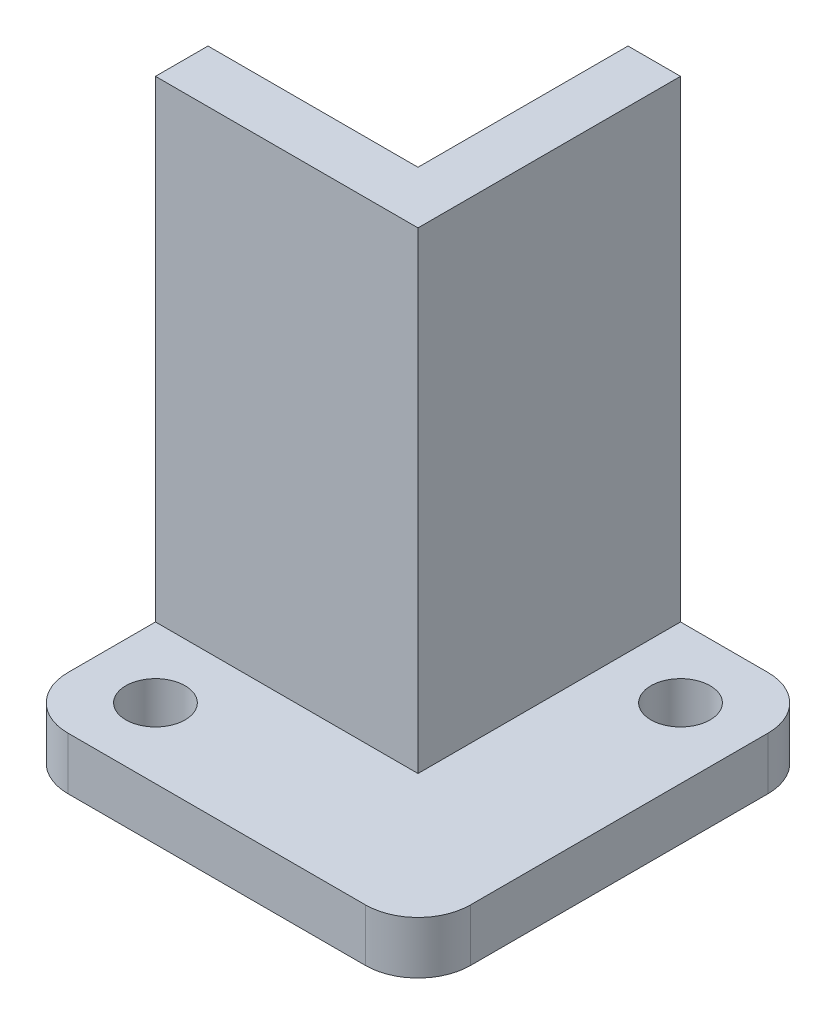
ISO-10303-21;
HEADER;
FILE_DESCRIPTION(('STEP AP214'),'2;1');
FILE_NAME('part.step','',(''),(''),'','','');
FILE_SCHEMA(('AUTOMOTIVE_DESIGN { 1 0 10303 214 1 1 1 1 }'));
ENDSEC;
DATA;
#1=APPLICATION_CONTEXT('core data for automotive mechanical design processes');
#2=APPLICATION_PROTOCOL_DEFINITION('international standard','automotive_design',2000,#1);
#3=PRODUCT_CONTEXT('',#1,'mechanical');
#4=PRODUCT('Part','Part','',(#3));
#5=PRODUCT_RELATED_PRODUCT_CATEGORY('part','',(#4));
#6=PRODUCT_DEFINITION_FORMATION('','',#4);
#7=PRODUCT_DEFINITION_CONTEXT('part definition',#1,'design');
#8=PRODUCT_DEFINITION('design','',#6,#7);
#9=PRODUCT_DEFINITION_SHAPE('','',#8);
#10=(LENGTH_UNIT() NAMED_UNIT(*) SI_UNIT(.MILLI.,.METRE.));
#11=(NAMED_UNIT(*) PLANE_ANGLE_UNIT() SI_UNIT($,.RADIAN.));
#12=(NAMED_UNIT(*) SI_UNIT($,.STERADIAN.) SOLID_ANGLE_UNIT());
#13=UNCERTAINTY_MEASURE_WITH_UNIT(LENGTH_MEASURE(1.E-05),#10,'distance_accuracy_value','');
#14=(GEOMETRIC_REPRESENTATION_CONTEXT(3) GLOBAL_UNCERTAINTY_ASSIGNED_CONTEXT((#13)) GLOBAL_UNIT_ASSIGNED_CONTEXT((#10,
#11,#12)) REPRESENTATION_CONTEXT('',''));
#15=CARTESIAN_POINT('',(0.,0.,0.));
#16=DIRECTION('',(0.,0.,1.));
#17=DIRECTION('',(1.,0.,0.));
#18=AXIS2_PLACEMENT_3D('',#15,#16,#17);
#19=CARTESIAN_POINT('',(0.,3.81,0.));
#20=DIRECTION('',(0.,-1.,0.));
#21=DIRECTION('',(0.,0.,-1.));
#22=AXIS2_PLACEMENT_3D('',#19,#20,#21);
#23=PLANE('',#22);
#24=CARTESIAN_POINT('',(5.08,3.81,-5.08));
#25=DIRECTION('',(0.,1.,0.));
#26=DIRECTION('',(0.,0.,1.));
#27=AXIS2_PLACEMENT_3D('',#24,#25,#26);
#28=CIRCLE('',#27,2.15);
#29=CARTESIAN_POINT('',(5.08,3.81,-2.93));
#30=VERTEX_POINT('',#29);
#31=EDGE_CURVE('E260',#30,#30,#28,.T.);
#32=ORIENTED_EDGE('',*,*,#31,.F.);
#33=EDGE_LOOP('',(#32));
#34=FACE_BOUND('',#33,.T.);
#35=CARTESIAN_POINT('',(24.13,3.81,-24.13));
#36=DIRECTION('',(0.,1.,0.));
#37=DIRECTION('',(0.,0.,1.));
#38=AXIS2_PLACEMENT_3D('',#35,#36,#37);
#39=CIRCLE('',#38,2.15);
#40=CARTESIAN_POINT('',(24.13,3.81,-21.98));
#41=VERTEX_POINT('',#40);
#42=EDGE_CURVE('E254',#41,#41,#39,.T.);
#43=ORIENTED_EDGE('',*,*,#42,.F.);
#44=EDGE_LOOP('',(#43));
#45=FACE_BOUND('',#44,.T.);
#46=DIRECTION('',(0.,0.,-1.));
#47=VECTOR('',#46,1.);
#48=CARTESIAN_POINT('',(29.21,3.81,0.));
#49=LINE('',#48,#47);
#50=CARTESIAN_POINT('',(29.21,3.81,-3.81));
#51=VERTEX_POINT('',#50);
#52=CARTESIAN_POINT('',(29.21,3.81,-25.4));
#53=VERTEX_POINT('',#52);
#54=EDGE_CURVE('E162',#51,#53,#49,.T.);
#55=ORIENTED_EDGE('',*,*,#54,.T.);
#56=CARTESIAN_POINT('',(25.4,3.81,-25.4));
#57=DIRECTION('',(0.,-1.,0.));
#58=DIRECTION('',(0.,0.,-1.));
#59=AXIS2_PLACEMENT_3D('',#56,#57,#58);
#60=CIRCLE('',#59,3.81);
#61=CARTESIAN_POINT('',(25.4,3.81,-29.21));
#62=VERTEX_POINT('',#61);
#63=EDGE_CURVE('E201',#53,#62,#60,.F.);
#64=ORIENTED_EDGE('',*,*,#63,.T.);
#65=DIRECTION('',(-1.,0.,0.));
#66=VECTOR('',#65,1.);
#67=CARTESIAN_POINT('',(29.21,3.81,-29.21));
#68=LINE('',#67,#66);
#69=CARTESIAN_POINT('',(19.05,3.81,-29.21));
#70=VERTEX_POINT('',#69);
#71=EDGE_CURVE('E165',#62,#70,#68,.T.);
#72=ORIENTED_EDGE('',*,*,#71,.T.);
#73=DIRECTION('',(0.,0.,-1.));
#74=VECTOR('',#73,1.);
#75=CARTESIAN_POINT('',(19.05,3.81,-10.16));
#76=LINE('',#75,#74);
#77=CARTESIAN_POINT('',(19.05,3.81,-10.16));
#78=VERTEX_POINT('',#77);
#79=EDGE_CURVE('E144',#78,#70,#76,.T.);
#80=ORIENTED_EDGE('',*,*,#79,.F.);
#81=DIRECTION('',(1.,0.,0.));
#82=VECTOR('',#81,1.);
#83=CARTESIAN_POINT('',(0.,3.81,-10.16));
#84=LINE('',#83,#82);
#85=CARTESIAN_POINT('',(0.,3.81,-10.16));
#86=VERTEX_POINT('',#85);
#87=EDGE_CURVE('E243',#86,#78,#84,.T.);
#88=ORIENTED_EDGE('',*,*,#87,.F.);
#89=DIRECTION('',(0.,0.,1.));
#90=VECTOR('',#89,1.);
#91=CARTESIAN_POINT('',(0.,3.81,0.));
#92=LINE('',#91,#90);
#93=CARTESIAN_POINT('',(0.,3.81,-3.81));
#94=VERTEX_POINT('',#93);
#95=EDGE_CURVE('E149',#86,#94,#92,.T.);
#96=ORIENTED_EDGE('',*,*,#95,.T.);
#97=CARTESIAN_POINT('',(3.81,3.81,-3.81));
#98=DIRECTION('',(0.,-1.,0.));
#99=DIRECTION('',(0.,0.,-1.));
#100=AXIS2_PLACEMENT_3D('',#97,#98,#99);
#101=CIRCLE('',#100,3.81);
#102=CARTESIAN_POINT('',(3.81,3.81,0.));
#103=VERTEX_POINT('',#102);
#104=EDGE_CURVE('E55',#94,#103,#101,.F.);
#105=ORIENTED_EDGE('',*,*,#104,.T.);
#106=DIRECTION('',(1.,0.,0.));
#107=VECTOR('',#106,1.);
#108=CARTESIAN_POINT('',(0.,3.81,0.));
#109=LINE('',#108,#107);
#110=CARTESIAN_POINT('',(25.4,3.81,0.));
#111=VERTEX_POINT('',#110);
#112=EDGE_CURVE('E159',#103,#111,#109,.T.);
#113=ORIENTED_EDGE('',*,*,#112,.T.);
#114=CARTESIAN_POINT('',(25.4,3.81,-3.81));
#115=DIRECTION('',(0.,-1.,0.));
#116=DIRECTION('',(0.,0.,-1.));
#117=AXIS2_PLACEMENT_3D('',#114,#115,#116);
#118=CIRCLE('',#117,3.81);
#119=EDGE_CURVE('E199',#111,#51,#118,.F.);
#120=ORIENTED_EDGE('',*,*,#119,.T.);
#121=EDGE_LOOP('',(#55,#64,#72,#80,#88,#96,#105,#113,#120));
#122=FACE_BOUND('',#121,.T.);
#123=ADVANCED_FACE('F34',(#34,#45,#122),#23,.F.);
#124=CARTESIAN_POINT('',(0.,3.81,0.));
#125=DIRECTION('',(1.,0.,0.));
#126=DIRECTION('',(0.,0.,-1.));
#127=AXIS2_PLACEMENT_3D('',#124,#125,#126);
#128=PLANE('',#127);
#129=DIRECTION('',(0.,0.,1.));
#130=VECTOR('',#129,1.);
#131=CARTESIAN_POINT('',(0.,0.,0.));
#132=LINE('',#131,#130);
#133=CARTESIAN_POINT('',(0.,0.,-13.97));
#134=VERTEX_POINT('',#133);
#135=CARTESIAN_POINT('',(0.,0.,-3.81));
#136=VERTEX_POINT('',#135);
#137=EDGE_CURVE('E150',#134,#136,#132,.T.);
#138=ORIENTED_EDGE('',*,*,#137,.T.);
#139=DIRECTION('',(0.,-1.,0.));
#140=VECTOR('',#139,1.);
#141=CARTESIAN_POINT('',(0.,3.81,-3.81));
#142=LINE('',#141,#140);
#143=EDGE_CURVE('E11',#136,#94,#142,.F.);
#144=ORIENTED_EDGE('',*,*,#143,.T.);
#145=ORIENTED_EDGE('',*,*,#95,.F.);
#146=DIRECTION('',(0.,-1.,0.));
#147=VECTOR('',#146,1.);
#148=CARTESIAN_POINT('',(0.,38.1,-10.16));
#149=LINE('',#148,#147);
#150=CARTESIAN_POINT('',(0.,38.1,-10.16));
#151=VERTEX_POINT('',#150);
#152=EDGE_CURVE('E128',#151,#86,#149,.T.);
#153=ORIENTED_EDGE('',*,*,#152,.F.);
#154=DIRECTION('',(0.,0.,1.));
#155=VECTOR('',#154,1.);
#156=CARTESIAN_POINT('',(0.,38.1,-13.97));
#157=LINE('',#156,#155);
#158=CARTESIAN_POINT('',(0.,38.1,-13.97));
#159=VERTEX_POINT('',#158);
#160=EDGE_CURVE('E134',#159,#151,#157,.T.);
#161=ORIENTED_EDGE('',*,*,#160,.F.);
#162=DIRECTION('',(0.,-1.,0.));
#163=VECTOR('',#162,1.);
#164=CARTESIAN_POINT('',(0.,3.81,-13.97));
#165=LINE('',#164,#163);
#166=EDGE_CURVE('E166',#159,#134,#165,.T.);
#167=ORIENTED_EDGE('',*,*,#166,.T.);
#168=EDGE_LOOP('',(#138,#144,#145,#153,#161,#167));
#169=FACE_BOUND('',#168,.T.);
#170=ADVANCED_FACE('F148',(#169),#128,.F.);
#171=CARTESIAN_POINT('',(0.,3.81,0.));
#172=DIRECTION('',(0.,0.,-1.));
#173=DIRECTION('',(-1.,0.,0.));
#174=AXIS2_PLACEMENT_3D('',#171,#172,#173);
#175=PLANE('',#174);
#176=DIRECTION('',(1.,0.,0.));
#177=VECTOR('',#176,1.);
#178=CARTESIAN_POINT('',(0.,0.,0.));
#179=LINE('',#178,#177);
#180=CARTESIAN_POINT('',(3.81,0.,0.));
#181=VERTEX_POINT('',#180);
#182=CARTESIAN_POINT('',(25.4,0.,0.));
#183=VERTEX_POINT('',#182);
#184=EDGE_CURVE('E152',#181,#183,#179,.T.);
#185=ORIENTED_EDGE('',*,*,#184,.T.);
#186=DIRECTION('',(0.,-1.,0.));
#187=VECTOR('',#186,1.);
#188=CARTESIAN_POINT('',(25.4,3.81,0.));
#189=LINE('',#188,#187);
#190=EDGE_CURVE('E42',#183,#111,#189,.F.);
#191=ORIENTED_EDGE('',*,*,#190,.T.);
#192=ORIENTED_EDGE('',*,*,#112,.F.);
#193=DIRECTION('',(0.,-1.,0.));
#194=VECTOR('',#193,1.);
#195=CARTESIAN_POINT('',(3.81,3.81,0.));
#196=LINE('',#195,#194);
#197=EDGE_CURVE('E203',#103,#181,#196,.T.);
#198=ORIENTED_EDGE('',*,*,#197,.T.);
#199=EDGE_LOOP('',(#185,#191,#192,#198));
#200=FACE_BOUND('',#199,.T.);
#201=ADVANCED_FACE('F207',(#200),#175,.F.);
#202=CARTESIAN_POINT('',(29.21,3.81,0.));
#203=DIRECTION('',(-1.,0.,0.));
#204=DIRECTION('',(0.,0.,1.));
#205=AXIS2_PLACEMENT_3D('',#202,#203,#204);
#206=PLANE('',#205);
#207=DIRECTION('',(0.,0.,-1.));
#208=VECTOR('',#207,1.);
#209=CARTESIAN_POINT('',(29.21,0.,0.));
#210=LINE('',#209,#208);
#211=CARTESIAN_POINT('',(29.21,0.,-3.81));
#212=VERTEX_POINT('',#211);
#213=CARTESIAN_POINT('',(29.21,0.,-25.4));
#214=VERTEX_POINT('',#213);
#215=EDGE_CURVE('E169',#212,#214,#210,.T.);
#216=ORIENTED_EDGE('',*,*,#215,.T.);
#217=DIRECTION('',(0.,-1.,0.));
#218=VECTOR('',#217,1.);
#219=CARTESIAN_POINT('',(29.21,3.81,-25.4));
#220=LINE('',#219,#218);
#221=EDGE_CURVE('E196',#214,#53,#220,.F.);
#222=ORIENTED_EDGE('',*,*,#221,.T.);
#223=ORIENTED_EDGE('',*,*,#54,.F.);
#224=DIRECTION('',(0.,-1.,0.));
#225=VECTOR('',#224,1.);
#226=CARTESIAN_POINT('',(29.21,3.81,-3.81));
#227=LINE('',#226,#225);
#228=EDGE_CURVE('E193',#51,#212,#227,.T.);
#229=ORIENTED_EDGE('',*,*,#228,.T.);
#230=EDGE_LOOP('',(#216,#222,#223,#229));
#231=FACE_BOUND('',#230,.T.);
#232=ADVANCED_FACE('F220',(#231),#206,.F.);
#233=CARTESIAN_POINT('',(29.21,3.81,-29.21));
#234=DIRECTION('',(0.,0.,1.));
#235=DIRECTION('',(1.,0.,0.));
#236=AXIS2_PLACEMENT_3D('',#233,#234,#235);
#237=PLANE('',#236);
#238=ORIENTED_EDGE('',*,*,#71,.F.);
#239=DIRECTION('',(0.,-1.,0.));
#240=VECTOR('',#239,1.);
#241=CARTESIAN_POINT('',(25.4,3.81,-29.21));
#242=LINE('',#241,#240);
#243=CARTESIAN_POINT('',(25.4,0.,-29.21));
#244=VERTEX_POINT('',#243);
#245=EDGE_CURVE('E184',#62,#244,#242,.T.);
#246=ORIENTED_EDGE('',*,*,#245,.T.);
#247=DIRECTION('',(-1.,0.,0.));
#248=VECTOR('',#247,1.);
#249=CARTESIAN_POINT('',(29.21,0.,-29.21));
#250=LINE('',#249,#248);
#251=CARTESIAN_POINT('',(15.24,0.,-29.21));
#252=VERTEX_POINT('',#251);
#253=EDGE_CURVE('E172',#244,#252,#250,.T.);
#254=ORIENTED_EDGE('',*,*,#253,.T.);
#255=DIRECTION('',(0.,-1.,0.));
#256=VECTOR('',#255,1.);
#257=CARTESIAN_POINT('',(15.24,3.81,-29.21));
#258=LINE('',#257,#256);
#259=CARTESIAN_POINT('',(15.24,38.1,-29.21));
#260=VERTEX_POINT('',#259);
#261=EDGE_CURVE('E181',#260,#252,#258,.T.);
#262=ORIENTED_EDGE('',*,*,#261,.F.);
#263=DIRECTION('',(-1.,0.,0.));
#264=VECTOR('',#263,1.);
#265=CARTESIAN_POINT('',(19.05,38.1,-29.21));
#266=LINE('',#265,#264);
#267=CARTESIAN_POINT('',(19.05,38.1,-29.21));
#268=VERTEX_POINT('',#267);
#269=EDGE_CURVE('E239',#268,#260,#266,.T.);
#270=ORIENTED_EDGE('',*,*,#269,.F.);
#271=DIRECTION('',(0.,-1.,0.));
#272=VECTOR('',#271,1.);
#273=CARTESIAN_POINT('',(19.05,38.1,-29.21));
#274=LINE('',#273,#272);
#275=EDGE_CURVE('E154',#268,#70,#274,.T.);
#276=ORIENTED_EDGE('',*,*,#275,.T.);
#277=EDGE_LOOP('',(#238,#246,#254,#262,#270,#276));
#278=FACE_BOUND('',#277,.T.);
#279=ADVANCED_FACE('F228',(#278),#237,.F.);
#280=CARTESIAN_POINT('',(15.24,3.81,-13.97));
#281=DIRECTION('',(1.,0.,0.));
#282=DIRECTION('',(0.,0.,-1.));
#283=AXIS2_PLACEMENT_3D('',#280,#281,#282);
#284=PLANE('',#283);
#285=DIRECTION('',(0.,0.,1.));
#286=VECTOR('',#285,1.);
#287=CARTESIAN_POINT('',(15.24,0.,-13.97));
#288=LINE('',#287,#286);
#289=CARTESIAN_POINT('',(15.24,0.,-13.97));
#290=VERTEX_POINT('',#289);
#291=EDGE_CURVE('E174',#252,#290,#288,.T.);
#292=ORIENTED_EDGE('',*,*,#291,.T.);
#293=DIRECTION('',(0.,-1.,0.));
#294=VECTOR('',#293,1.);
#295=CARTESIAN_POINT('',(15.24,3.81,-13.97));
#296=LINE('',#295,#294);
#297=CARTESIAN_POINT('',(15.24,38.1,-13.97));
#298=VERTEX_POINT('',#297);
#299=EDGE_CURVE('E178',#298,#290,#296,.T.);
#300=ORIENTED_EDGE('',*,*,#299,.F.);
#301=DIRECTION('',(0.,0.,1.));
#302=VECTOR('',#301,1.);
#303=CARTESIAN_POINT('',(15.24,38.1,-13.97));
#304=LINE('',#303,#302);
#305=EDGE_CURVE('E237',#260,#298,#304,.T.);
#306=ORIENTED_EDGE('',*,*,#305,.F.);
#307=ORIENTED_EDGE('',*,*,#261,.T.);
#308=EDGE_LOOP('',(#292,#300,#306,#307));
#309=FACE_BOUND('',#308,.T.);
#310=ADVANCED_FACE('F233',(#309),#284,.F.);
#311=CARTESIAN_POINT('',(0.,3.81,-13.97));
#312=DIRECTION('',(0.,0.,1.));
#313=DIRECTION('',(1.,0.,0.));
#314=AXIS2_PLACEMENT_3D('',#311,#312,#313);
#315=PLANE('',#314);
#316=DIRECTION('',(-1.,0.,0.));
#317=VECTOR('',#316,1.);
#318=CARTESIAN_POINT('',(0.,0.,-13.97));
#319=LINE('',#318,#317);
#320=EDGE_CURVE('E160',#290,#134,#319,.T.);
#321=ORIENTED_EDGE('',*,*,#320,.T.);
#322=ORIENTED_EDGE('',*,*,#166,.F.);
#323=DIRECTION('',(-1.,0.,0.));
#324=VECTOR('',#323,1.);
#325=CARTESIAN_POINT('',(0.,38.1,-13.97));
#326=LINE('',#325,#324);
#327=EDGE_CURVE('E141',#298,#159,#326,.T.);
#328=ORIENTED_EDGE('',*,*,#327,.F.);
#329=ORIENTED_EDGE('',*,*,#299,.T.);
#330=EDGE_LOOP('',(#321,#322,#328,#329));
#331=FACE_BOUND('',#330,.T.);
#332=ADVANCED_FACE('F236',(#331),#315,.F.);
#333=CARTESIAN_POINT('',(0.,0.,0.));
#334=DIRECTION('',(0.,-1.,0.));
#335=DIRECTION('',(0.,0.,-1.));
#336=AXIS2_PLACEMENT_3D('',#333,#334,#335);
#337=PLANE('',#336);
#338=CARTESIAN_POINT('',(5.08,0.,-5.08));
#339=DIRECTION('',(0.,1.,0.));
#340=DIRECTION('',(0.,0.,1.));
#341=AXIS2_PLACEMENT_3D('',#338,#339,#340);
#342=CIRCLE('',#341,2.15);
#343=CARTESIAN_POINT('',(5.08,0.,-2.93));
#344=VERTEX_POINT('',#343);
#345=EDGE_CURVE('E245',#344,#344,#342,.T.);
#346=ORIENTED_EDGE('',*,*,#345,.T.);
#347=EDGE_LOOP('',(#346));
#348=FACE_BOUND('',#347,.T.);
#349=CARTESIAN_POINT('',(24.13,0.,-24.13));
#350=DIRECTION('',(0.,1.,0.));
#351=DIRECTION('',(0.,0.,1.));
#352=AXIS2_PLACEMENT_3D('',#349,#350,#351);
#353=CIRCLE('',#352,2.15);
#354=CARTESIAN_POINT('',(24.13,0.,-21.98));
#355=VERTEX_POINT('',#354);
#356=EDGE_CURVE('E257',#355,#355,#353,.T.);
#357=ORIENTED_EDGE('',*,*,#356,.T.);
#358=EDGE_LOOP('',(#357));
#359=FACE_BOUND('',#358,.T.);
#360=ORIENTED_EDGE('',*,*,#253,.F.);
#361=CARTESIAN_POINT('',(25.4,0.,-25.4));
#362=DIRECTION('',(0.,-1.,0.));
#363=DIRECTION('',(0.,0.,-1.));
#364=AXIS2_PLACEMENT_3D('',#361,#362,#363);
#365=CIRCLE('',#364,3.81);
#366=EDGE_CURVE('E191',#244,#214,#365,.T.);
#367=ORIENTED_EDGE('',*,*,#366,.T.);
#368=ORIENTED_EDGE('',*,*,#215,.F.);
#369=CARTESIAN_POINT('',(25.4,0.,-3.81));
#370=DIRECTION('',(0.,-1.,0.));
#371=DIRECTION('',(0.,0.,-1.));
#372=AXIS2_PLACEMENT_3D('',#369,#370,#371);
#373=CIRCLE('',#372,3.81);
#374=EDGE_CURVE('E189',#212,#183,#373,.T.);
#375=ORIENTED_EDGE('',*,*,#374,.T.);
#376=ORIENTED_EDGE('',*,*,#184,.F.);
#377=CARTESIAN_POINT('',(3.81,0.,-3.81));
#378=DIRECTION('',(0.,-1.,0.));
#379=DIRECTION('',(0.,0.,-1.));
#380=AXIS2_PLACEMENT_3D('',#377,#378,#379);
#381=CIRCLE('',#380,3.81);
#382=EDGE_CURVE('E187',#181,#136,#381,.T.);
#383=ORIENTED_EDGE('',*,*,#382,.T.);
#384=ORIENTED_EDGE('',*,*,#137,.F.);
#385=ORIENTED_EDGE('',*,*,#320,.F.);
#386=ORIENTED_EDGE('',*,*,#291,.F.);
#387=EDGE_LOOP('',(#360,#367,#368,#375,#376,#383,#384,#385,#386));
#388=FACE_BOUND('',#387,.T.);
#389=ADVANCED_FACE('F211',(#348,#359,#388),#337,.T.);
#390=CARTESIAN_POINT('',(0.,38.1,-10.16));
#391=DIRECTION('',(0.,0.,-1.));
#392=DIRECTION('',(-1.,0.,0.));
#393=AXIS2_PLACEMENT_3D('',#390,#391,#392);
#394=PLANE('',#393);
#395=ORIENTED_EDGE('',*,*,#87,.T.);
#396=DIRECTION('',(0.,-1.,0.));
#397=VECTOR('',#396,1.);
#398=CARTESIAN_POINT('',(19.05,38.1,-10.16));
#399=LINE('',#398,#397);
#400=CARTESIAN_POINT('',(19.05,38.1,-10.16));
#401=VERTEX_POINT('',#400);
#402=EDGE_CURVE('E130',#401,#78,#399,.T.);
#403=ORIENTED_EDGE('',*,*,#402,.F.);
#404=DIRECTION('',(1.,0.,0.));
#405=VECTOR('',#404,1.);
#406=CARTESIAN_POINT('',(0.,38.1,-10.16));
#407=LINE('',#406,#405);
#408=EDGE_CURVE('E123',#151,#401,#407,.T.);
#409=ORIENTED_EDGE('',*,*,#408,.F.);
#410=ORIENTED_EDGE('',*,*,#152,.T.);
#411=EDGE_LOOP('',(#395,#403,#409,#410));
#412=FACE_BOUND('',#411,.T.);
#413=ADVANCED_FACE('F126',(#412),#394,.F.);
#414=CARTESIAN_POINT('',(19.05,38.1,-10.16));
#415=DIRECTION('',(-1.,0.,0.));
#416=DIRECTION('',(0.,0.,1.));
#417=AXIS2_PLACEMENT_3D('',#414,#415,#416);
#418=PLANE('',#417);
#419=ORIENTED_EDGE('',*,*,#79,.T.);
#420=ORIENTED_EDGE('',*,*,#275,.F.);
#421=DIRECTION('',(0.,0.,-1.));
#422=VECTOR('',#421,1.);
#423=CARTESIAN_POINT('',(19.05,38.1,-10.16));
#424=LINE('',#423,#422);
#425=EDGE_CURVE('E133',#401,#268,#424,.T.);
#426=ORIENTED_EDGE('',*,*,#425,.F.);
#427=ORIENTED_EDGE('',*,*,#402,.T.);
#428=EDGE_LOOP('',(#419,#420,#426,#427));
#429=FACE_BOUND('',#428,.T.);
#430=ADVANCED_FACE('F249',(#429),#418,.F.);
#431=CARTESIAN_POINT('',(0.,38.1,0.));
#432=DIRECTION('',(0.,1.,0.));
#433=DIRECTION('',(0.,0.,1.));
#434=AXIS2_PLACEMENT_3D('',#431,#432,#433);
#435=PLANE('',#434);
#436=ORIENTED_EDGE('',*,*,#160,.T.);
#437=ORIENTED_EDGE('',*,*,#408,.T.);
#438=ORIENTED_EDGE('',*,*,#425,.T.);
#439=ORIENTED_EDGE('',*,*,#269,.T.);
#440=ORIENTED_EDGE('',*,*,#305,.T.);
#441=ORIENTED_EDGE('',*,*,#327,.T.);
#442=EDGE_LOOP('',(#436,#437,#438,#439,#440,#441));
#443=FACE_BOUND('',#442,.T.);
#444=ADVANCED_FACE('F138',(#443),#435,.T.);
#445=CARTESIAN_POINT('',(24.13,0.,-24.13));
#446=DIRECTION('',(0.,1.,0.));
#447=DIRECTION('',(0.,0.,1.));
#448=AXIS2_PLACEMENT_3D('',#445,#446,#447);
#449=CYLINDRICAL_SURFACE('',#448,2.15);
#450=ORIENTED_EDGE('',*,*,#356,.F.);
#451=EDGE_LOOP('',(#450));
#452=FACE_BOUND('',#451,.T.);
#453=ORIENTED_EDGE('',*,*,#42,.T.);
#454=EDGE_LOOP('',(#453));
#455=FACE_BOUND('',#454,.T.);
#456=ADVANCED_FACE('F271',(#452,#455),#449,.F.);
#457=CARTESIAN_POINT('',(5.08,0.,-5.08));
#458=DIRECTION('',(0.,1.,0.));
#459=DIRECTION('',(0.,0.,1.));
#460=AXIS2_PLACEMENT_3D('',#457,#458,#459);
#461=CYLINDRICAL_SURFACE('',#460,2.15);
#462=ORIENTED_EDGE('',*,*,#345,.F.);
#463=EDGE_LOOP('',(#462));
#464=FACE_BOUND('',#463,.T.);
#465=ORIENTED_EDGE('',*,*,#31,.T.);
#466=EDGE_LOOP('',(#465));
#467=FACE_BOUND('',#466,.T.);
#468=ADVANCED_FACE('F268',(#464,#467),#461,.F.);
#469=CARTESIAN_POINT('',(25.4,3.81,-25.4));
#470=DIRECTION('',(0.,-1.,0.));
#471=DIRECTION('',(0.,0.,-1.));
#472=AXIS2_PLACEMENT_3D('',#469,#470,#471);
#473=CYLINDRICAL_SURFACE('',#472,3.81);
#474=ORIENTED_EDGE('',*,*,#63,.F.);
#475=ORIENTED_EDGE('',*,*,#221,.F.);
#476=ORIENTED_EDGE('',*,*,#366,.F.);
#477=ORIENTED_EDGE('',*,*,#245,.F.);
#478=EDGE_LOOP('',(#474,#475,#476,#477));
#479=FACE_BOUND('',#478,.T.);
#480=ADVANCED_FACE('F226',(#479),#473,.T.);
#481=CARTESIAN_POINT('',(25.4,3.81,-3.81));
#482=DIRECTION('',(0.,-1.,0.));
#483=DIRECTION('',(0.,0.,-1.));
#484=AXIS2_PLACEMENT_3D('',#481,#482,#483);
#485=CYLINDRICAL_SURFACE('',#484,3.81);
#486=ORIENTED_EDGE('',*,*,#119,.F.);
#487=ORIENTED_EDGE('',*,*,#190,.F.);
#488=ORIENTED_EDGE('',*,*,#374,.F.);
#489=ORIENTED_EDGE('',*,*,#228,.F.);
#490=EDGE_LOOP('',(#486,#487,#488,#489));
#491=FACE_BOUND('',#490,.T.);
#492=ADVANCED_FACE('F217',(#491),#485,.T.);
#493=CARTESIAN_POINT('',(3.81,3.81,-3.81));
#494=DIRECTION('',(0.,-1.,0.));
#495=DIRECTION('',(0.,0.,-1.));
#496=AXIS2_PLACEMENT_3D('',#493,#494,#495);
#497=CYLINDRICAL_SURFACE('',#496,3.81);
#498=ORIENTED_EDGE('',*,*,#104,.F.);
#499=ORIENTED_EDGE('',*,*,#143,.F.);
#500=ORIENTED_EDGE('',*,*,#382,.F.);
#501=ORIENTED_EDGE('',*,*,#197,.F.);
#502=EDGE_LOOP('',(#498,#499,#500,#501));
#503=FACE_BOUND('',#502,.T.);
#504=ADVANCED_FACE('F36',(#503),#497,.T.);
#505=CLOSED_SHELL('',(#123,#170,#201,#232,#279,#310,#332,#389,#413,#430,#444,#456,#468,#480,
#492,#504));
#506=MANIFOLD_SOLID_BREP('B2',#505);
#507=ADVANCED_BREP_SHAPE_REPRESENTATION('',(#18,#506),#14);
#508=SHAPE_DEFINITION_REPRESENTATION(#9,#507);
ENDSEC;
END-ISO-10303-21;
